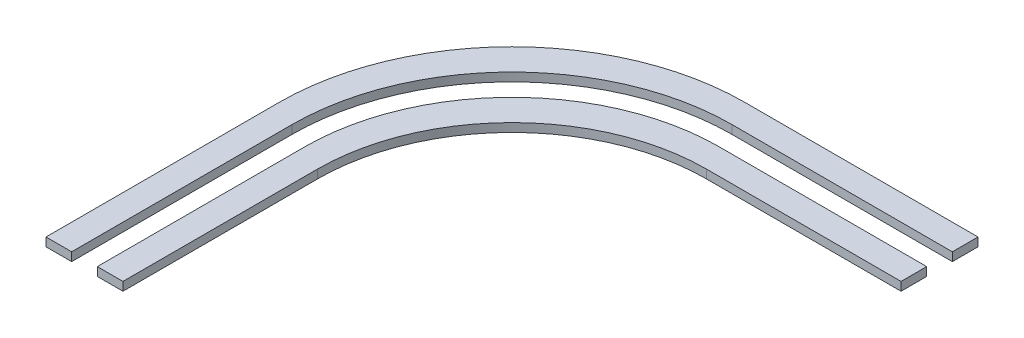
ISO-10303-21;
HEADER;
FILE_DESCRIPTION(('STEP AP214'),'2;1');
FILE_NAME('part.step','',(''),(''),'','','');
FILE_SCHEMA(('AUTOMOTIVE_DESIGN { 1 0 10303 214 1 1 1 1 }'));
ENDSEC;
DATA;
#1=APPLICATION_CONTEXT('core data for automotive mechanical design processes');
#2=APPLICATION_PROTOCOL_DEFINITION('international standard','automotive_design',2000,#1);
#3=PRODUCT_CONTEXT('',#1,'mechanical');
#4=PRODUCT('Part','Part','',(#3));
#5=PRODUCT_RELATED_PRODUCT_CATEGORY('part','',(#4));
#6=PRODUCT_DEFINITION_FORMATION('','',#4);
#7=PRODUCT_DEFINITION_CONTEXT('part definition',#1,'design');
#8=PRODUCT_DEFINITION('design','',#6,#7);
#9=PRODUCT_DEFINITION_SHAPE('','',#8);
#10=(LENGTH_UNIT() NAMED_UNIT(*) SI_UNIT(.MILLI.,.METRE.));
#11=(NAMED_UNIT(*) PLANE_ANGLE_UNIT() SI_UNIT($,.RADIAN.));
#12=(NAMED_UNIT(*) SI_UNIT($,.STERADIAN.) SOLID_ANGLE_UNIT());
#13=UNCERTAINTY_MEASURE_WITH_UNIT(LENGTH_MEASURE(1.E-05),#10,'distance_accuracy_value','');
#14=(GEOMETRIC_REPRESENTATION_CONTEXT(3) GLOBAL_UNCERTAINTY_ASSIGNED_CONTEXT((#13)) GLOBAL_UNIT_ASSIGNED_CONTEXT((#10,
#11,#12)) REPRESENTATION_CONTEXT('',''));
#15=CARTESIAN_POINT('',(0.,0.,0.));
#16=DIRECTION('',(0.,0.,1.));
#17=DIRECTION('',(1.,0.,0.));
#18=AXIS2_PLACEMENT_3D('',#15,#16,#17);
#19=CARTESIAN_POINT('',(772.5,10.,-227.5));
#20=DIRECTION('',(0.,-1.,0.));
#21=DIRECTION('',(0.,0.,-1.));
#22=AXIS2_PLACEMENT_3D('',#19,#20,#21);
#23=CYLINDRICAL_SURFACE('',#22,227.5);
#24=CARTESIAN_POINT('',(772.5,0.,-227.5));
#25=DIRECTION('',(0.,1.,0.));
#26=DIRECTION('',(0.,0.,1.));
#27=AXIS2_PLACEMENT_3D('',#24,#25,#26);
#28=CIRCLE('',#27,227.5);
#29=CARTESIAN_POINT('',(772.5,0.,-455.));
#30=VERTEX_POINT('',#29);
#31=CARTESIAN_POINT('',(545.,0.,-227.5));
#32=VERTEX_POINT('',#31);
#33=EDGE_CURVE('E195',#30,#32,#28,.T.);
#34=ORIENTED_EDGE('',*,*,#33,.F.);
#35=DIRECTION('',(0.,-1.,0.));
#36=VECTOR('',#35,1.);
#37=CARTESIAN_POINT('',(772.5,10.,-455.));
#38=LINE('',#37,#36);
#39=CARTESIAN_POINT('',(772.5,10.,-455.));
#40=VERTEX_POINT('',#39);
#41=EDGE_CURVE('E13',#40,#30,#38,.T.);
#42=ORIENTED_EDGE('',*,*,#41,.F.);
#43=CARTESIAN_POINT('',(772.5,10.,-227.5));
#44=DIRECTION('',(0.,1.,0.));
#45=DIRECTION('',(0.,0.,1.));
#46=AXIS2_PLACEMENT_3D('',#43,#44,#45);
#47=CIRCLE('',#46,227.5);
#48=CARTESIAN_POINT('',(545.,10.,-227.5));
#49=VERTEX_POINT('',#48);
#50=EDGE_CURVE('E214',#40,#49,#47,.T.);
#51=ORIENTED_EDGE('',*,*,#50,.T.);
#52=DIRECTION('',(0.,-1.,0.));
#53=VECTOR('',#52,1.);
#54=CARTESIAN_POINT('',(545.,10.,-227.5));
#55=LINE('',#54,#53);
#56=EDGE_CURVE('E151',#49,#32,#55,.T.);
#57=ORIENTED_EDGE('',*,*,#56,.T.);
#58=EDGE_LOOP('',(#34,#42,#51,#57));
#59=FACE_BOUND('',#58,.T.);
#60=ADVANCED_FACE('F101',(#59),#23,.F.);
#61=CARTESIAN_POINT('',(0.,10.,-455.));
#62=DIRECTION('',(0.,0.,1.));
#63=DIRECTION('',(1.,0.,0.));
#64=AXIS2_PLACEMENT_3D('',#61,#62,#63);
#65=PLANE('',#64);
#66=DIRECTION('',(-1.,0.,0.));
#67=VECTOR('',#66,1.);
#68=CARTESIAN_POINT('',(0.,0.,-455.));
#69=LINE('',#68,#67);
#70=CARTESIAN_POINT('',(1000.,0.,-455.));
#71=VERTEX_POINT('',#70);
#72=EDGE_CURVE('E198',#71,#30,#69,.T.);
#73=ORIENTED_EDGE('',*,*,#72,.F.);
#74=DIRECTION('',(0.,-1.,0.));
#75=VECTOR('',#74,1.);
#76=CARTESIAN_POINT('',(1000.,10.,-455.));
#77=LINE('',#76,#75);
#78=CARTESIAN_POINT('',(1000.,10.,-455.));
#79=VERTEX_POINT('',#78);
#80=EDGE_CURVE('E109',#79,#71,#77,.T.);
#81=ORIENTED_EDGE('',*,*,#80,.F.);
#82=DIRECTION('',(-1.,0.,0.));
#83=VECTOR('',#82,1.);
#84=CARTESIAN_POINT('',(0.,10.,-455.));
#85=LINE('',#84,#83);
#86=EDGE_CURVE('E236',#79,#40,#85,.T.);
#87=ORIENTED_EDGE('',*,*,#86,.T.);
#88=ORIENTED_EDGE('',*,*,#41,.T.);
#89=EDGE_LOOP('',(#73,#81,#87,#88));
#90=FACE_BOUND('',#89,.T.);
#91=ADVANCED_FACE('F235',(#90),#65,.T.);
#92=CARTESIAN_POINT('',(1000.,10.,0.));
#93=DIRECTION('',(-1.,0.,0.));
#94=DIRECTION('',(0.,0.,1.));
#95=AXIS2_PLACEMENT_3D('',#92,#93,#94);
#96=PLANE('',#95);
#97=DIRECTION('',(0.,0.,-1.));
#98=VECTOR('',#97,1.);
#99=CARTESIAN_POINT('',(1000.,0.,0.));
#100=LINE('',#99,#98);
#101=CARTESIAN_POINT('',(1000.,0.,-485.));
#102=VERTEX_POINT('',#101);
#103=EDGE_CURVE('E201',#71,#102,#100,.T.);
#104=ORIENTED_EDGE('',*,*,#103,.T.);
#105=DIRECTION('',(0.,-1.,0.));
#106=VECTOR('',#105,1.);
#107=CARTESIAN_POINT('',(1000.,10.,-485.));
#108=LINE('',#107,#106);
#109=CARTESIAN_POINT('',(1000.,10.,-485.));
#110=VERTEX_POINT('',#109);
#111=EDGE_CURVE('E220',#110,#102,#108,.T.);
#112=ORIENTED_EDGE('',*,*,#111,.F.);
#113=DIRECTION('',(0.,0.,-1.));
#114=VECTOR('',#113,1.);
#115=CARTESIAN_POINT('',(1000.,10.,0.));
#116=LINE('',#115,#114);
#117=EDGE_CURVE('E226',#79,#110,#116,.T.);
#118=ORIENTED_EDGE('',*,*,#117,.F.);
#119=ORIENTED_EDGE('',*,*,#80,.T.);
#120=EDGE_LOOP('',(#104,#112,#118,#119));
#121=FACE_BOUND('',#120,.T.);
#122=ADVANCED_FACE('F224',(#121),#96,.F.);
#123=CARTESIAN_POINT('',(0.,10.,-485.));
#124=DIRECTION('',(0.,0.,-1.));
#125=DIRECTION('',(-1.,0.,0.));
#126=AXIS2_PLACEMENT_3D('',#123,#124,#125);
#127=PLANE('',#126);
#128=DIRECTION('',(1.,0.,0.));
#129=VECTOR('',#128,1.);
#130=CARTESIAN_POINT('',(0.,0.,-485.));
#131=LINE('',#130,#129);
#132=CARTESIAN_POINT('',(757.5,0.,-485.));
#133=VERTEX_POINT('',#132);
#134=EDGE_CURVE('E204',#133,#102,#131,.T.);
#135=ORIENTED_EDGE('',*,*,#134,.F.);
#136=DIRECTION('',(0.,-1.,0.));
#137=VECTOR('',#136,1.);
#138=CARTESIAN_POINT('',(757.5,10.,-485.));
#139=LINE('',#138,#137);
#140=CARTESIAN_POINT('',(757.5,10.,-485.));
#141=VERTEX_POINT('',#140);
#142=EDGE_CURVE('E218',#141,#133,#139,.T.);
#143=ORIENTED_EDGE('',*,*,#142,.F.);
#144=DIRECTION('',(1.,0.,0.));
#145=VECTOR('',#144,1.);
#146=CARTESIAN_POINT('',(0.,10.,-485.));
#147=LINE('',#146,#145);
#148=EDGE_CURVE('E190',#141,#110,#147,.T.);
#149=ORIENTED_EDGE('',*,*,#148,.T.);
#150=ORIENTED_EDGE('',*,*,#111,.T.);
#151=EDGE_LOOP('',(#135,#143,#149,#150));
#152=FACE_BOUND('',#151,.T.);
#153=ADVANCED_FACE('F245',(#152),#127,.T.);
#154=CARTESIAN_POINT('',(757.5,10.,-242.5));
#155=DIRECTION('',(0.,-1.,0.));
#156=DIRECTION('',(0.,0.,-1.));
#157=AXIS2_PLACEMENT_3D('',#154,#155,#156);
#158=CYLINDRICAL_SURFACE('',#157,242.5);
#159=CARTESIAN_POINT('',(757.5,0.,-242.5));
#160=DIRECTION('',(0.,1.,0.));
#161=DIRECTION('',(0.,0.,1.));
#162=AXIS2_PLACEMENT_3D('',#159,#160,#161);
#163=CIRCLE('',#162,242.5);
#164=CARTESIAN_POINT('',(515.,0.,-242.5));
#165=VERTEX_POINT('',#164);
#166=EDGE_CURVE('E207',#133,#165,#163,.T.);
#167=ORIENTED_EDGE('',*,*,#166,.T.);
#168=DIRECTION('',(0.,-1.,0.));
#169=VECTOR('',#168,1.);
#170=CARTESIAN_POINT('',(515.,10.,-242.5));
#171=LINE('',#170,#169);
#172=CARTESIAN_POINT('',(515.,10.,-242.5));
#173=VERTEX_POINT('',#172);
#174=EDGE_CURVE('E178',#173,#165,#171,.T.);
#175=ORIENTED_EDGE('',*,*,#174,.F.);
#176=CARTESIAN_POINT('',(757.5,10.,-242.5));
#177=DIRECTION('',(0.,1.,0.));
#178=DIRECTION('',(0.,0.,1.));
#179=AXIS2_PLACEMENT_3D('',#176,#177,#178);
#180=CIRCLE('',#179,242.5);
#181=EDGE_CURVE('E187',#141,#173,#180,.T.);
#182=ORIENTED_EDGE('',*,*,#181,.F.);
#183=ORIENTED_EDGE('',*,*,#142,.T.);
#184=EDGE_LOOP('',(#167,#175,#182,#183));
#185=FACE_BOUND('',#184,.T.);
#186=ADVANCED_FACE('F247',(#185),#158,.T.);
#187=CARTESIAN_POINT('',(515.,10.,0.));
#188=DIRECTION('',(-1.,0.,0.));
#189=DIRECTION('',(0.,0.,1.));
#190=AXIS2_PLACEMENT_3D('',#187,#188,#189);
#191=PLANE('',#190);
#192=DIRECTION('',(0.,0.,-1.));
#193=VECTOR('',#192,1.);
#194=CARTESIAN_POINT('',(515.,0.,0.));
#195=LINE('',#194,#193);
#196=CARTESIAN_POINT('',(515.,0.,0.));
#197=VERTEX_POINT('',#196);
#198=EDGE_CURVE('E177',#197,#165,#195,.T.);
#199=ORIENTED_EDGE('',*,*,#198,.F.);
#200=DIRECTION('',(0.,-1.,0.));
#201=VECTOR('',#200,1.);
#202=CARTESIAN_POINT('',(515.,10.,0.));
#203=LINE('',#202,#201);
#204=CARTESIAN_POINT('',(515.,10.,0.));
#205=VERTEX_POINT('',#204);
#206=EDGE_CURVE('E171',#205,#197,#203,.T.);
#207=ORIENTED_EDGE('',*,*,#206,.F.);
#208=DIRECTION('',(0.,0.,-1.));
#209=VECTOR('',#208,1.);
#210=CARTESIAN_POINT('',(515.,10.,0.));
#211=LINE('',#210,#209);
#212=EDGE_CURVE('E175',#205,#173,#211,.T.);
#213=ORIENTED_EDGE('',*,*,#212,.T.);
#214=ORIENTED_EDGE('',*,*,#174,.T.);
#215=EDGE_LOOP('',(#199,#207,#213,#214));
#216=FACE_BOUND('',#215,.T.);
#217=ADVANCED_FACE('F173',(#216),#191,.T.);
#218=CARTESIAN_POINT('',(0.,10.,0.));
#219=DIRECTION('',(0.,0.,-1.));
#220=DIRECTION('',(-1.,0.,0.));
#221=AXIS2_PLACEMENT_3D('',#218,#219,#220);
#222=PLANE('',#221);
#223=DIRECTION('',(1.,0.,0.));
#224=VECTOR('',#223,1.);
#225=CARTESIAN_POINT('',(0.,0.,0.));
#226=LINE('',#225,#224);
#227=CARTESIAN_POINT('',(545.,0.,0.));
#228=VERTEX_POINT('',#227);
#229=EDGE_CURVE('E144',#197,#228,#226,.T.);
#230=ORIENTED_EDGE('',*,*,#229,.T.);
#231=DIRECTION('',(0.,-1.,0.));
#232=VECTOR('',#231,1.);
#233=CARTESIAN_POINT('',(545.,10.,0.));
#234=LINE('',#233,#232);
#235=CARTESIAN_POINT('',(545.,10.,0.));
#236=VERTEX_POINT('',#235);
#237=EDGE_CURVE('E179',#236,#228,#234,.T.);
#238=ORIENTED_EDGE('',*,*,#237,.F.);
#239=DIRECTION('',(1.,0.,0.));
#240=VECTOR('',#239,1.);
#241=CARTESIAN_POINT('',(0.,10.,0.));
#242=LINE('',#241,#240);
#243=EDGE_CURVE('E181',#205,#236,#242,.T.);
#244=ORIENTED_EDGE('',*,*,#243,.F.);
#245=ORIENTED_EDGE('',*,*,#206,.T.);
#246=EDGE_LOOP('',(#230,#238,#244,#245));
#247=FACE_BOUND('',#246,.T.);
#248=ADVANCED_FACE('F182',(#247),#222,.F.);
#249=CARTESIAN_POINT('',(545.,10.,2.65965515789323E-13));
#250=DIRECTION('',(-1.,0.,0.));
#251=DIRECTION('',(0.,0.,1.));
#252=AXIS2_PLACEMENT_3D('',#249,#250,#251);
#253=PLANE('',#252);
#254=DIRECTION('',(0.,0.,-1.));
#255=VECTOR('',#254,1.);
#256=CARTESIAN_POINT('',(545.,0.,2.65965515789323E-13));
#257=LINE('',#256,#255);
#258=EDGE_CURVE('E212',#228,#32,#257,.T.);
#259=ORIENTED_EDGE('',*,*,#258,.T.);
#260=ORIENTED_EDGE('',*,*,#56,.F.);
#261=DIRECTION('',(0.,0.,-1.));
#262=VECTOR('',#261,1.);
#263=CARTESIAN_POINT('',(545.,10.,2.65965515789323E-13));
#264=LINE('',#263,#262);
#265=EDGE_CURVE('E117',#236,#49,#264,.T.);
#266=ORIENTED_EDGE('',*,*,#265,.F.);
#267=ORIENTED_EDGE('',*,*,#237,.T.);
#268=EDGE_LOOP('',(#259,#260,#266,#267));
#269=FACE_BOUND('',#268,.T.);
#270=ADVANCED_FACE('F239',(#269),#253,.F.);
#271=CARTESIAN_POINT('',(0.,10.,0.));
#272=DIRECTION('',(0.,1.,0.));
#273=DIRECTION('',(0.,0.,1.));
#274=AXIS2_PLACEMENT_3D('',#271,#272,#273);
#275=PLANE('',#274);
#276=ORIENTED_EDGE('',*,*,#50,.F.);
#277=ORIENTED_EDGE('',*,*,#86,.F.);
#278=ORIENTED_EDGE('',*,*,#117,.T.);
#279=ORIENTED_EDGE('',*,*,#148,.F.);
#280=ORIENTED_EDGE('',*,*,#181,.T.);
#281=ORIENTED_EDGE('',*,*,#212,.F.);
#282=ORIENTED_EDGE('',*,*,#243,.T.);
#283=ORIENTED_EDGE('',*,*,#265,.T.);
#284=EDGE_LOOP('',(#276,#277,#278,#279,#280,#281,#282,#283));
#285=FACE_BOUND('',#284,.T.);
#286=ADVANCED_FACE('F184',(#285),#275,.T.);
#287=CARTESIAN_POINT('',(0.,0.,0.));
#288=DIRECTION('',(0.,1.,0.));
#289=DIRECTION('',(0.,0.,1.));
#290=AXIS2_PLACEMENT_3D('',#287,#288,#289);
#291=PLANE('',#290);
#292=ORIENTED_EDGE('',*,*,#33,.T.);
#293=ORIENTED_EDGE('',*,*,#258,.F.);
#294=ORIENTED_EDGE('',*,*,#229,.F.);
#295=ORIENTED_EDGE('',*,*,#198,.T.);
#296=ORIENTED_EDGE('',*,*,#166,.F.);
#297=ORIENTED_EDGE('',*,*,#134,.T.);
#298=ORIENTED_EDGE('',*,*,#103,.F.);
#299=ORIENTED_EDGE('',*,*,#72,.T.);
#300=EDGE_LOOP('',(#292,#293,#294,#295,#296,#297,#298,#299));
#301=FACE_BOUND('',#300,.T.);
#302=ADVANCED_FACE('F232',(#301),#291,.F.);
#303=CLOSED_SHELL('',(#60,#91,#122,#153,#186,#217,#248,#270,#286,#302));
#304=MANIFOLD_SOLID_BREP('B2',#303);
#305=CARTESIAN_POINT('',(0.,10.,-545.));
#306=DIRECTION('',(0.,0.,1.));
#307=DIRECTION('',(1.,0.,0.));
#308=AXIS2_PLACEMENT_3D('',#305,#306,#307);
#309=PLANE('',#308);
#310=DIRECTION('',(-1.,0.,0.));
#311=VECTOR('',#310,1.);
#312=CARTESIAN_POINT('',(0.,0.,-545.));
#313=LINE('',#312,#311);
#314=CARTESIAN_POINT('',(1000.,0.,-545.));
#315=VERTEX_POINT('',#314);
#316=CARTESIAN_POINT('',(727.5,0.,-545.));
#317=VERTEX_POINT('',#316);
#318=EDGE_CURVE('E482',#315,#317,#313,.T.);
#319=ORIENTED_EDGE('',*,*,#318,.T.);
#320=DIRECTION('',(0.,-1.,0.));
#321=VECTOR('',#320,1.);
#322=CARTESIAN_POINT('',(727.5,10.,-545.));
#323=LINE('',#322,#321);
#324=CARTESIAN_POINT('',(727.5,10.,-545.));
#325=VERTEX_POINT('',#324);
#326=EDGE_CURVE('E99',#325,#317,#323,.T.);
#327=ORIENTED_EDGE('',*,*,#326,.F.);
#328=DIRECTION('',(-1.,0.,0.));
#329=VECTOR('',#328,1.);
#330=CARTESIAN_POINT('',(0.,10.,-545.));
#331=LINE('',#330,#329);
#332=CARTESIAN_POINT('',(1000.,10.,-545.));
#333=VERTEX_POINT('',#332);
#334=EDGE_CURVE('E507',#333,#325,#331,.T.);
#335=ORIENTED_EDGE('',*,*,#334,.F.);
#336=DIRECTION('',(0.,-1.,0.));
#337=VECTOR('',#336,1.);
#338=CARTESIAN_POINT('',(1000.,10.,-545.));
#339=LINE('',#338,#337);
#340=EDGE_CURVE('E481',#333,#315,#339,.T.);
#341=ORIENTED_EDGE('',*,*,#340,.T.);
#342=EDGE_LOOP('',(#319,#327,#335,#341));
#343=FACE_BOUND('',#342,.T.);
#344=ADVANCED_FACE('F379',(#343),#309,.F.);
#345=CARTESIAN_POINT('',(727.5,10.,-272.5));
#346=DIRECTION('',(0.,-1.,0.));
#347=DIRECTION('',(0.,0.,-1.));
#348=AXIS2_PLACEMENT_3D('',#345,#346,#347);
#349=CYLINDRICAL_SURFACE('',#348,272.5);
#350=CARTESIAN_POINT('',(727.5,0.,-272.5));
#351=DIRECTION('',(0.,1.,0.));
#352=DIRECTION('',(0.,0.,1.));
#353=AXIS2_PLACEMENT_3D('',#350,#351,#352);
#354=CIRCLE('',#353,272.5);
#355=CARTESIAN_POINT('',(455.,0.,-272.5));
#356=VERTEX_POINT('',#355);
#357=EDGE_CURVE('E486',#317,#356,#354,.T.);
#358=ORIENTED_EDGE('',*,*,#357,.T.);
#359=DIRECTION('',(0.,-1.,0.));
#360=VECTOR('',#359,1.);
#361=CARTESIAN_POINT('',(455.,10.,-272.5));
#362=LINE('',#361,#360);
#363=CARTESIAN_POINT('',(455.,10.,-272.5));
#364=VERTEX_POINT('',#363);
#365=EDGE_CURVE('E388',#364,#356,#362,.T.);
#366=ORIENTED_EDGE('',*,*,#365,.F.);
#367=CARTESIAN_POINT('',(727.5,10.,-272.5));
#368=DIRECTION('',(0.,1.,0.));
#369=DIRECTION('',(0.,0.,1.));
#370=AXIS2_PLACEMENT_3D('',#367,#368,#369);
#371=CIRCLE('',#370,272.5);
#372=EDGE_CURVE('E438',#325,#364,#371,.T.);
#373=ORIENTED_EDGE('',*,*,#372,.F.);
#374=ORIENTED_EDGE('',*,*,#326,.T.);
#375=EDGE_LOOP('',(#358,#366,#373,#374));
#376=FACE_BOUND('',#375,.T.);
#377=ADVANCED_FACE('F527',(#376),#349,.T.);
#378=CARTESIAN_POINT('',(455.,10.,0.));
#379=DIRECTION('',(-1.,0.,0.));
#380=DIRECTION('',(0.,0.,1.));
#381=AXIS2_PLACEMENT_3D('',#378,#379,#380);
#382=PLANE('',#381);
#383=DIRECTION('',(0.,0.,-1.));
#384=VECTOR('',#383,1.);
#385=CARTESIAN_POINT('',(455.,0.,0.));
#386=LINE('',#385,#384);
#387=CARTESIAN_POINT('',(455.,0.,0.));
#388=VERTEX_POINT('',#387);
#389=EDGE_CURVE('E490',#388,#356,#386,.T.);
#390=ORIENTED_EDGE('',*,*,#389,.F.);
#391=DIRECTION('',(0.,-1.,0.));
#392=VECTOR('',#391,1.);
#393=CARTESIAN_POINT('',(455.,10.,0.));
#394=LINE('',#393,#392);
#395=CARTESIAN_POINT('',(455.,10.,0.));
#396=VERTEX_POINT('',#395);
#397=EDGE_CURVE('E518',#396,#388,#394,.T.);
#398=ORIENTED_EDGE('',*,*,#397,.F.);
#399=DIRECTION('',(0.,0.,-1.));
#400=VECTOR('',#399,1.);
#401=CARTESIAN_POINT('',(455.,10.,0.));
#402=LINE('',#401,#400);
#403=EDGE_CURVE('E526',#396,#364,#402,.T.);
#404=ORIENTED_EDGE('',*,*,#403,.T.);
#405=ORIENTED_EDGE('',*,*,#365,.T.);
#406=EDGE_LOOP('',(#390,#398,#404,#405));
#407=FACE_BOUND('',#406,.T.);
#408=ADVANCED_FACE('F524',(#407),#382,.T.);
#409=CARTESIAN_POINT('',(0.,10.,0.));
#410=DIRECTION('',(0.,0.,-1.));
#411=DIRECTION('',(-1.,0.,0.));
#412=AXIS2_PLACEMENT_3D('',#409,#410,#411);
#413=PLANE('',#412);
#414=DIRECTION('',(1.,0.,0.));
#415=VECTOR('',#414,1.);
#416=CARTESIAN_POINT('',(0.,0.,0.));
#417=LINE('',#416,#415);
#418=CARTESIAN_POINT('',(485.,0.,0.));
#419=VERTEX_POINT('',#418);
#420=EDGE_CURVE('E494',#388,#419,#417,.T.);
#421=ORIENTED_EDGE('',*,*,#420,.T.);
#422=DIRECTION('',(0.,-1.,0.));
#423=VECTOR('',#422,1.);
#424=CARTESIAN_POINT('',(485.,10.,0.));
#425=LINE('',#424,#423);
#426=CARTESIAN_POINT('',(485.,10.,0.));
#427=VERTEX_POINT('',#426);
#428=EDGE_CURVE('E514',#427,#419,#425,.T.);
#429=ORIENTED_EDGE('',*,*,#428,.F.);
#430=DIRECTION('',(1.,0.,0.));
#431=VECTOR('',#430,1.);
#432=CARTESIAN_POINT('',(0.,10.,0.));
#433=LINE('',#432,#431);
#434=EDGE_CURVE('E475',#396,#427,#433,.T.);
#435=ORIENTED_EDGE('',*,*,#434,.F.);
#436=ORIENTED_EDGE('',*,*,#397,.T.);
#437=EDGE_LOOP('',(#421,#429,#435,#436));
#438=FACE_BOUND('',#437,.T.);
#439=ADVANCED_FACE('F536',(#438),#413,.F.);
#440=CARTESIAN_POINT('',(485.,10.,0.));
#441=DIRECTION('',(-1.,0.,0.));
#442=DIRECTION('',(0.,0.,1.));
#443=AXIS2_PLACEMENT_3D('',#440,#441,#442);
#444=PLANE('',#443);
#445=DIRECTION('',(0.,0.,-1.));
#446=VECTOR('',#445,1.);
#447=CARTESIAN_POINT('',(485.,0.,0.));
#448=LINE('',#447,#446);
#449=CARTESIAN_POINT('',(485.,0.,-257.5));
#450=VERTEX_POINT('',#449);
#451=EDGE_CURVE('E497',#419,#450,#448,.T.);
#452=ORIENTED_EDGE('',*,*,#451,.T.);
#453=DIRECTION('',(0.,-1.,0.));
#454=VECTOR('',#453,1.);
#455=CARTESIAN_POINT('',(485.,10.,-257.5));
#456=LINE('',#455,#454);
#457=CARTESIAN_POINT('',(485.,10.,-257.5));
#458=VERTEX_POINT('',#457);
#459=EDGE_CURVE('E461',#458,#450,#456,.T.);
#460=ORIENTED_EDGE('',*,*,#459,.F.);
#461=DIRECTION('',(0.,0.,-1.));
#462=VECTOR('',#461,1.);
#463=CARTESIAN_POINT('',(485.,10.,0.));
#464=LINE('',#463,#462);
#465=EDGE_CURVE('E470',#427,#458,#464,.T.);
#466=ORIENTED_EDGE('',*,*,#465,.F.);
#467=ORIENTED_EDGE('',*,*,#428,.T.);
#468=EDGE_LOOP('',(#452,#460,#466,#467));
#469=FACE_BOUND('',#468,.T.);
#470=ADVANCED_FACE('F539',(#469),#444,.F.);
#471=CARTESIAN_POINT('',(742.5,10.,-257.5));
#472=DIRECTION('',(0.,-1.,0.));
#473=DIRECTION('',(0.,0.,-1.));
#474=AXIS2_PLACEMENT_3D('',#471,#472,#473);
#475=CYLINDRICAL_SURFACE('',#474,257.5);
#476=CARTESIAN_POINT('',(742.5,0.,-257.5));
#477=DIRECTION('',(0.,1.,0.));
#478=DIRECTION('',(0.,0.,1.));
#479=AXIS2_PLACEMENT_3D('',#476,#477,#478);
#480=CIRCLE('',#479,257.5);
#481=CARTESIAN_POINT('',(742.5,0.,-515.));
#482=VERTEX_POINT('',#481);
#483=EDGE_CURVE('E459',#482,#450,#480,.T.);
#484=ORIENTED_EDGE('',*,*,#483,.F.);
#485=DIRECTION('',(0.,-1.,0.));
#486=VECTOR('',#485,1.);
#487=CARTESIAN_POINT('',(742.5,10.,-515.));
#488=LINE('',#487,#486);
#489=CARTESIAN_POINT('',(742.5,10.,-515.));
#490=VERTEX_POINT('',#489);
#491=EDGE_CURVE('E453',#490,#482,#488,.T.);
#492=ORIENTED_EDGE('',*,*,#491,.F.);
#493=CARTESIAN_POINT('',(742.5,10.,-257.5));
#494=DIRECTION('',(0.,1.,0.));
#495=DIRECTION('',(0.,0.,1.));
#496=AXIS2_PLACEMENT_3D('',#493,#494,#495);
#497=CIRCLE('',#496,257.5);
#498=EDGE_CURVE('E457',#490,#458,#497,.T.);
#499=ORIENTED_EDGE('',*,*,#498,.T.);
#500=ORIENTED_EDGE('',*,*,#459,.T.);
#501=EDGE_LOOP('',(#484,#492,#499,#500));
#502=FACE_BOUND('',#501,.T.);
#503=ADVANCED_FACE('F455',(#502),#475,.F.);
#504=CARTESIAN_POINT('',(0.,10.,-515.));
#505=DIRECTION('',(0.,0.,-1.));
#506=DIRECTION('',(-1.,0.,0.));
#507=AXIS2_PLACEMENT_3D('',#504,#505,#506);
#508=PLANE('',#507);
#509=DIRECTION('',(1.,0.,0.));
#510=VECTOR('',#509,1.);
#511=CARTESIAN_POINT('',(0.,0.,-515.));
#512=LINE('',#511,#510);
#513=CARTESIAN_POINT('',(1000.,0.,-515.));
#514=VERTEX_POINT('',#513);
#515=EDGE_CURVE('E424',#482,#514,#512,.T.);
#516=ORIENTED_EDGE('',*,*,#515,.T.);
#517=DIRECTION('',(0.,-1.,0.));
#518=VECTOR('',#517,1.);
#519=CARTESIAN_POINT('',(1000.,10.,-515.));
#520=LINE('',#519,#518);
#521=CARTESIAN_POINT('',(1000.,10.,-515.));
#522=VERTEX_POINT('',#521);
#523=EDGE_CURVE('E462',#522,#514,#520,.T.);
#524=ORIENTED_EDGE('',*,*,#523,.F.);
#525=DIRECTION('',(1.,0.,0.));
#526=VECTOR('',#525,1.);
#527=CARTESIAN_POINT('',(0.,10.,-515.));
#528=LINE('',#527,#526);
#529=EDGE_CURVE('E464',#490,#522,#528,.T.);
#530=ORIENTED_EDGE('',*,*,#529,.F.);
#531=ORIENTED_EDGE('',*,*,#491,.T.);
#532=EDGE_LOOP('',(#516,#524,#530,#531));
#533=FACE_BOUND('',#532,.T.);
#534=ADVANCED_FACE('F465',(#533),#508,.F.);
#535=CARTESIAN_POINT('',(1000.,10.,0.));
#536=DIRECTION('',(-1.,0.,0.));
#537=DIRECTION('',(0.,0.,1.));
#538=AXIS2_PLACEMENT_3D('',#535,#536,#537);
#539=PLANE('',#538);
#540=DIRECTION('',(0.,0.,-1.));
#541=VECTOR('',#540,1.);
#542=CARTESIAN_POINT('',(1000.,0.,0.));
#543=LINE('',#542,#541);
#544=EDGE_CURVE('E430',#514,#315,#543,.T.);
#545=ORIENTED_EDGE('',*,*,#544,.T.);
#546=ORIENTED_EDGE('',*,*,#340,.F.);
#547=DIRECTION('',(0.,0.,-1.));
#548=VECTOR('',#547,1.);
#549=CARTESIAN_POINT('',(1000.,10.,0.));
#550=LINE('',#549,#548);
#551=EDGE_CURVE('E396',#522,#333,#550,.T.);
#552=ORIENTED_EDGE('',*,*,#551,.F.);
#553=ORIENTED_EDGE('',*,*,#523,.T.);
#554=EDGE_LOOP('',(#545,#546,#552,#553));
#555=FACE_BOUND('',#554,.T.);
#556=ADVANCED_FACE('F542',(#555),#539,.F.);
#557=CARTESIAN_POINT('',(0.,10.,0.));
#558=DIRECTION('',(0.,1.,0.));
#559=DIRECTION('',(0.,0.,1.));
#560=AXIS2_PLACEMENT_3D('',#557,#558,#559);
#561=PLANE('',#560);
#562=ORIENTED_EDGE('',*,*,#334,.T.);
#563=ORIENTED_EDGE('',*,*,#372,.T.);
#564=ORIENTED_EDGE('',*,*,#403,.F.);
#565=ORIENTED_EDGE('',*,*,#434,.T.);
#566=ORIENTED_EDGE('',*,*,#465,.T.);
#567=ORIENTED_EDGE('',*,*,#498,.F.);
#568=ORIENTED_EDGE('',*,*,#529,.T.);
#569=ORIENTED_EDGE('',*,*,#551,.T.);
#570=EDGE_LOOP('',(#562,#563,#564,#565,#566,#567,#568,#569));
#571=FACE_BOUND('',#570,.T.);
#572=ADVANCED_FACE('F468',(#571),#561,.T.);
#573=CARTESIAN_POINT('',(0.,0.,0.));
#574=DIRECTION('',(0.,1.,0.));
#575=DIRECTION('',(0.,0.,1.));
#576=AXIS2_PLACEMENT_3D('',#573,#574,#575);
#577=PLANE('',#576);
#578=ORIENTED_EDGE('',*,*,#318,.F.);
#579=ORIENTED_EDGE('',*,*,#544,.F.);
#580=ORIENTED_EDGE('',*,*,#515,.F.);
#581=ORIENTED_EDGE('',*,*,#483,.T.);
#582=ORIENTED_EDGE('',*,*,#451,.F.);
#583=ORIENTED_EDGE('',*,*,#420,.F.);
#584=ORIENTED_EDGE('',*,*,#389,.T.);
#585=ORIENTED_EDGE('',*,*,#357,.F.);
#586=EDGE_LOOP('',(#578,#579,#580,#581,#582,#583,#584,#585));
#587=FACE_BOUND('',#586,.T.);
#588=ADVANCED_FACE('F532',(#587),#577,.F.);
#589=CLOSED_SHELL('',(#344,#377,#408,#439,#470,#503,#534,#556,#572,#588));
#590=MANIFOLD_SOLID_BREP('B7',#589);
#591=ADVANCED_BREP_SHAPE_REPRESENTATION('',(#18,#304,#590),#14);
#592=SHAPE_DEFINITION_REPRESENTATION(#9,#591);
ENDSEC;
END-ISO-10303-21;
